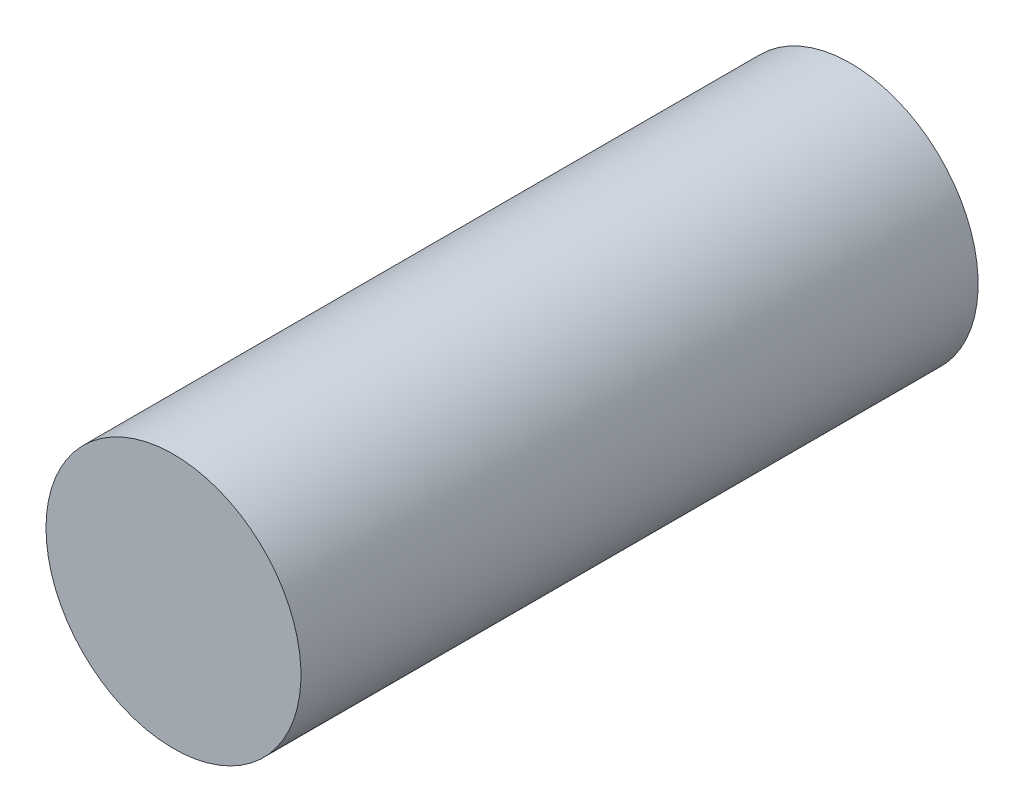
ISO-10303-21;
HEADER;
FILE_DESCRIPTION(('STEP AP214'),'2;1');
FILE_NAME('part.step','',(''),(''),'','','');
FILE_SCHEMA(('AUTOMOTIVE_DESIGN { 1 0 10303 214 1 1 1 1 }'));
ENDSEC;
DATA;
#1=APPLICATION_CONTEXT('core data for automotive mechanical design processes');
#2=APPLICATION_PROTOCOL_DEFINITION('international standard','automotive_design',2000,#1);
#3=PRODUCT_CONTEXT('',#1,'mechanical');
#4=PRODUCT('Part','Part','',(#3));
#5=PRODUCT_RELATED_PRODUCT_CATEGORY('part','',(#4));
#6=PRODUCT_DEFINITION_FORMATION('','',#4);
#7=PRODUCT_DEFINITION_CONTEXT('part definition',#1,'design');
#8=PRODUCT_DEFINITION('design','',#6,#7);
#9=PRODUCT_DEFINITION_SHAPE('','',#8);
#10=(LENGTH_UNIT() NAMED_UNIT(*) SI_UNIT(.MILLI.,.METRE.));
#11=(NAMED_UNIT(*) PLANE_ANGLE_UNIT() SI_UNIT($,.RADIAN.));
#12=(NAMED_UNIT(*) SI_UNIT($,.STERADIAN.) SOLID_ANGLE_UNIT());
#13=UNCERTAINTY_MEASURE_WITH_UNIT(LENGTH_MEASURE(1.E-05),#10,'distance_accuracy_value','');
#14=(GEOMETRIC_REPRESENTATION_CONTEXT(3) GLOBAL_UNCERTAINTY_ASSIGNED_CONTEXT((#13)) GLOBAL_UNIT_ASSIGNED_CONTEXT((#10,
#11,#12)) REPRESENTATION_CONTEXT('',''));
#15=CARTESIAN_POINT('',(0.,0.,0.));
#16=DIRECTION('',(0.,0.,1.));
#17=DIRECTION('',(1.,0.,0.));
#18=AXIS2_PLACEMENT_3D('',#15,#16,#17);
#19=CARTESIAN_POINT('',(-88.4260437715655,39.615555081333,0.));
#20=DIRECTION('',(0.,0.,1.));
#21=DIRECTION('',(1.,0.,0.));
#22=AXIS2_PLACEMENT_3D('',#19,#20,#21);
#23=PLANE('',#22);
#24=CARTESIAN_POINT('',(-88.4260437715655,39.615555081333,0.));
#25=DIRECTION('',(0.,0.,1.));
#26=DIRECTION('',(1.,0.,0.));
#27=AXIS2_PLACEMENT_3D('',#24,#25,#26);
#28=CIRCLE('',#27,32.);
#29=CARTESIAN_POINT('',(-120.426043771566,39.615555081333,0.));
#30=VERTEX_POINT('',#29);
#31=EDGE_CURVE('E10',#30,#30,#28,.T.);
#32=ORIENTED_EDGE('',*,*,#31,.F.);
#33=EDGE_LOOP('',(#32));
#34=FACE_BOUND('',#33,.T.);
#35=ADVANCED_FACE('F16',(#34),#23,.F.);
#36=CARTESIAN_POINT('',(-88.4260437715655,39.615555081333,170.));
#37=DIRECTION('',(0.,0.,1.));
#38=DIRECTION('',(1.,0.,0.));
#39=AXIS2_PLACEMENT_3D('',#36,#37,#38);
#40=PLANE('',#39);
#41=CARTESIAN_POINT('',(-88.4260437715655,39.615555081333,170.));
#42=DIRECTION('',(0.,0.,1.));
#43=DIRECTION('',(1.,0.,0.));
#44=AXIS2_PLACEMENT_3D('',#41,#42,#43);
#45=CIRCLE('',#44,32.);
#46=CARTESIAN_POINT('',(-120.426043771566,39.615555081333,170.));
#47=VERTEX_POINT('',#46);
#48=EDGE_CURVE('E41',#47,#47,#45,.T.);
#49=ORIENTED_EDGE('',*,*,#48,.T.);
#50=EDGE_LOOP('',(#49));
#51=FACE_BOUND('',#50,.T.);
#52=ADVANCED_FACE('F44',(#51),#40,.T.);
#53=CARTESIAN_POINT('',(-88.4260437715655,39.615555081333,0.));
#54=DIRECTION('',(0.,0.,1.));
#55=DIRECTION('',(1.,0.,0.));
#56=AXIS2_PLACEMENT_3D('',#53,#54,#55);
#57=CYLINDRICAL_SURFACE('',#56,32.);
#58=ORIENTED_EDGE('',*,*,#48,.F.);
#59=DIRECTION('',(0.,0.,-1.));
#60=VECTOR('',#59,1.);
#61=CARTESIAN_POINT('',(-120.426043771566,39.615555081333,0.));
#62=LINE('',#61,#60);
#63=EDGE_CURVE('E19',#47,#30,#62,.T.);
#64=ORIENTED_EDGE('',*,*,#63,.T.);
#65=ORIENTED_EDGE('',*,*,#31,.T.);
#66=ORIENTED_EDGE('',*,*,#63,.F.);
#67=EDGE_LOOP('',(#58,#64,#65,#66));
#68=FACE_BOUND('',#67,.T.);
#69=ADVANCED_FACE('F40',(#68),#57,.T.);
#70=CLOSED_SHELL('',(#35,#52,#69));
#71=MANIFOLD_SOLID_BREP('B1',#70);
#72=ADVANCED_BREP_SHAPE_REPRESENTATION('',(#18,#71),#14);
#73=SHAPE_DEFINITION_REPRESENTATION(#9,#72);
ENDSEC;
END-ISO-10303-21;
